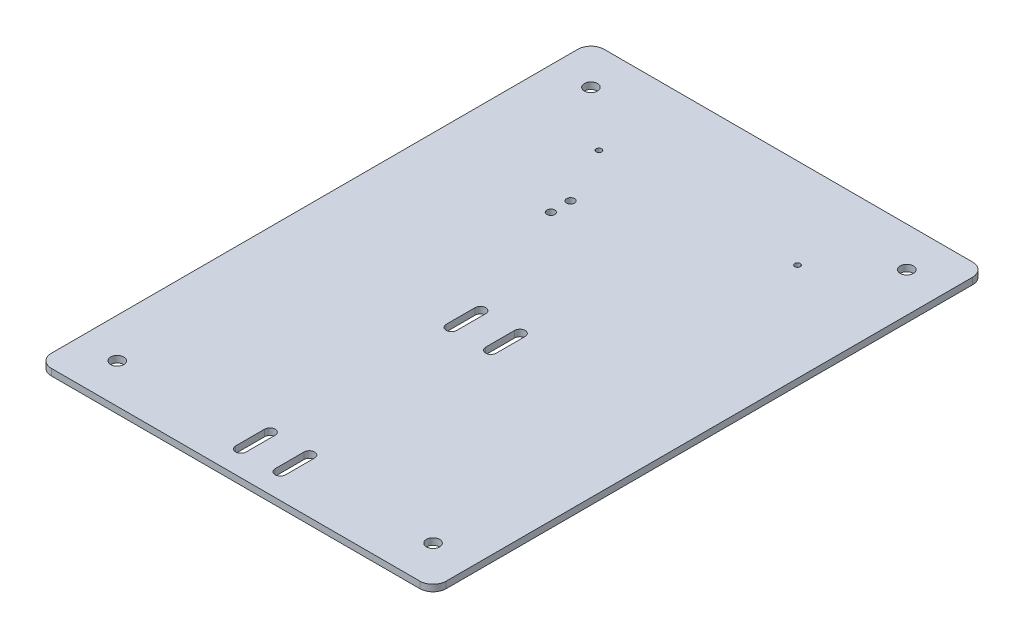
ISO-10303-21;
HEADER;
FILE_DESCRIPTION(('STEP AP214'),'2;1');
FILE_NAME('part.step','',(''),(''),'','','');
FILE_SCHEMA(('AUTOMOTIVE_DESIGN { 1 0 10303 214 1 1 1 1 }'));
ENDSEC;
DATA;
#1=APPLICATION_CONTEXT('core data for automotive mechanical design processes');
#2=APPLICATION_PROTOCOL_DEFINITION('international standard','automotive_design',2000,#1);
#3=PRODUCT_CONTEXT('',#1,'mechanical');
#4=PRODUCT('Part','Part','',(#3));
#5=PRODUCT_RELATED_PRODUCT_CATEGORY('part','',(#4));
#6=PRODUCT_DEFINITION_FORMATION('','',#4);
#7=PRODUCT_DEFINITION_CONTEXT('part definition',#1,'design');
#8=PRODUCT_DEFINITION('design','',#6,#7);
#9=PRODUCT_DEFINITION_SHAPE('','',#8);
#10=(LENGTH_UNIT() NAMED_UNIT(*) SI_UNIT(.MILLI.,.METRE.));
#11=(NAMED_UNIT(*) PLANE_ANGLE_UNIT() SI_UNIT($,.RADIAN.));
#12=(NAMED_UNIT(*) SI_UNIT($,.STERADIAN.) SOLID_ANGLE_UNIT());
#13=UNCERTAINTY_MEASURE_WITH_UNIT(LENGTH_MEASURE(1.E-05),#10,'distance_accuracy_value','');
#14=(GEOMETRIC_REPRESENTATION_CONTEXT(3) GLOBAL_UNCERTAINTY_ASSIGNED_CONTEXT((#13)) GLOBAL_UNIT_ASSIGNED_CONTEXT((#10,
#11,#12)) REPRESENTATION_CONTEXT('',''));
#15=CARTESIAN_POINT('',(0.,0.,0.));
#16=DIRECTION('',(0.,0.,1.));
#17=DIRECTION('',(1.,0.,0.));
#18=AXIS2_PLACEMENT_3D('',#15,#16,#17);
#19=CARTESIAN_POINT('',(-150.,-16.,300.));
#20=DIRECTION('',(1.,0.,0.));
#21=DIRECTION('',(0.,0.,-1.));
#22=AXIS2_PLACEMENT_3D('',#19,#20,#21);
#23=PLANE('',#22);
#24=DIRECTION('',(0.,0.,-1.));
#25=VECTOR('',#24,1.);
#26=CARTESIAN_POINT('',(-150.,-16.,300.));
#27=LINE('',#26,#25);
#28=CARTESIAN_POINT('',(-150.,-16.,290.));
#29=VERTEX_POINT('',#28);
#30=CARTESIAN_POINT('',(-150.,-16.,-110.));
#31=VERTEX_POINT('',#30);
#32=EDGE_CURVE('E382',#29,#31,#27,.T.);
#33=ORIENTED_EDGE('',*,*,#32,.T.);
#34=DIRECTION('',(0.,-1.,0.));
#35=VECTOR('',#34,1.);
#36=CARTESIAN_POINT('',(-150.,-16.,-110.));
#37=LINE('',#36,#35);
#38=CARTESIAN_POINT('',(-150.,-21.,-110.));
#39=VERTEX_POINT('',#38);
#40=EDGE_CURVE('E419',#31,#39,#37,.T.);
#41=ORIENTED_EDGE('',*,*,#40,.T.);
#42=DIRECTION('',(0.,0.,-1.));
#43=VECTOR('',#42,1.);
#44=CARTESIAN_POINT('',(-150.,-21.,300.));
#45=LINE('',#44,#43);
#46=CARTESIAN_POINT('',(-150.,-21.,290.));
#47=VERTEX_POINT('',#46);
#48=EDGE_CURVE('E394',#47,#39,#45,.T.);
#49=ORIENTED_EDGE('',*,*,#48,.F.);
#50=DIRECTION('',(0.,-1.,0.));
#51=VECTOR('',#50,1.);
#52=CARTESIAN_POINT('',(-150.,-16.,290.));
#53=LINE('',#52,#51);
#54=EDGE_CURVE('E398',#47,#29,#53,.F.);
#55=ORIENTED_EDGE('',*,*,#54,.T.);
#56=EDGE_LOOP('',(#33,#41,#49,#55));
#57=FACE_BOUND('',#56,.T.);
#58=ADVANCED_FACE('F45',(#57),#23,.F.);
#59=CARTESIAN_POINT('',(-150.,-21.,300.));
#60=DIRECTION('',(0.,1.,0.));
#61=DIRECTION('',(0.,0.,1.));
#62=AXIS2_PLACEMENT_3D('',#59,#60,#61);
#63=PLANE('',#62);
#64=CARTESIAN_POINT('',(75.5,-21.,-51.5));
#65=DIRECTION('',(0.,1.,0.));
#66=DIRECTION('',(0.,0.,1.));
#67=AXIS2_PLACEMENT_3D('',#64,#65,#66);
#68=CIRCLE('',#67,2.1);
#69=CARTESIAN_POINT('',(75.5,-21.,-49.4));
#70=VERTEX_POINT('',#69);
#71=EDGE_CURVE('E894',#70,#70,#68,.F.);
#72=ORIENTED_EDGE('',*,*,#71,.F.);
#73=EDGE_LOOP('',(#72));
#74=FACE_BOUND('',#73,.T.);
#75=CARTESIAN_POINT('',(-75.5,-21.,-51.5));
#76=DIRECTION('',(0.,1.,0.));
#77=DIRECTION('',(0.,0.,1.));
#78=AXIS2_PLACEMENT_3D('',#75,#76,#77);
#79=CIRCLE('',#78,2.1);
#80=CARTESIAN_POINT('',(-75.5,-21.,-49.4));
#81=VERTEX_POINT('',#80);
#82=EDGE_CURVE('E903',#81,#81,#79,.F.);
#83=ORIENTED_EDGE('',*,*,#82,.F.);
#84=EDGE_LOOP('',(#83));
#85=FACE_BOUND('',#84,.T.);
#86=CARTESIAN_POINT('',(-120.,-21.,270.));
#87=DIRECTION('',(0.,1.,0.));
#88=DIRECTION('',(0.,0.,1.));
#89=AXIS2_PLACEMENT_3D('',#86,#87,#88);
#90=CIRCLE('',#89,5.00000000000003);
#91=CARTESIAN_POINT('',(-120.,-21.,275.));
#92=VERTEX_POINT('',#91);
#93=EDGE_CURVE('E889',#92,#92,#90,.F.);
#94=ORIENTED_EDGE('',*,*,#93,.F.);
#95=EDGE_LOOP('',(#94));
#96=FACE_BOUND('',#95,.T.);
#97=CARTESIAN_POINT('',(120.,-21.,270.));
#98=DIRECTION('',(0.,1.,0.));
#99=DIRECTION('',(0.,0.,1.));
#100=AXIS2_PLACEMENT_3D('',#97,#98,#99);
#101=CIRCLE('',#100,5.00000000000001);
#102=CARTESIAN_POINT('',(120.,-21.,275.));
#103=VERTEX_POINT('',#102);
#104=EDGE_CURVE('E893',#103,#103,#101,.F.);
#105=ORIENTED_EDGE('',*,*,#104,.F.);
#106=EDGE_LOOP('',(#105));
#107=FACE_BOUND('',#106,.T.);
#108=CARTESIAN_POINT('',(120.,-21.,-90.));
#109=DIRECTION('',(0.,1.,0.));
#110=DIRECTION('',(0.,0.,1.));
#111=AXIS2_PLACEMENT_3D('',#108,#109,#110);
#112=CIRCLE('',#111,5.00000000000001);
#113=CARTESIAN_POINT('',(120.,-21.,-85.));
#114=VERTEX_POINT('',#113);
#115=EDGE_CURVE('E888',#114,#114,#112,.F.);
#116=ORIENTED_EDGE('',*,*,#115,.F.);
#117=EDGE_LOOP('',(#116));
#118=FACE_BOUND('',#117,.T.);
#119=CARTESIAN_POINT('',(-120.,-21.,-90.));
#120=DIRECTION('',(0.,1.,0.));
#121=DIRECTION('',(0.,0.,1.));
#122=AXIS2_PLACEMENT_3D('',#119,#120,#121);
#123=CIRCLE('',#122,5.00000000000001);
#124=CARTESIAN_POINT('',(-120.,-21.,-85.));
#125=VERTEX_POINT('',#124);
#126=EDGE_CURVE('E404',#125,#125,#123,.F.);
#127=ORIENTED_EDGE('',*,*,#126,.F.);
#128=EDGE_LOOP('',(#127));
#129=FACE_BOUND('',#128,.T.);
#130=CARTESIAN_POINT('',(-53.,-21.,-7.5));
#131=DIRECTION('',(0.,1.,0.));
#132=DIRECTION('',(0.,0.,1.));
#133=AXIS2_PLACEMENT_3D('',#130,#131,#132);
#134=CIRCLE('',#133,3.);
#135=CARTESIAN_POINT('',(-53.,-21.,-4.5));
#136=VERTEX_POINT('',#135);
#137=EDGE_CURVE('E874',#136,#136,#134,.F.);
#138=ORIENTED_EDGE('',*,*,#137,.F.);
#139=EDGE_LOOP('',(#138));
#140=FACE_BOUND('',#139,.T.);
#141=CARTESIAN_POINT('',(-53.,-21.,7.5));
#142=DIRECTION('',(0.,1.,0.));
#143=DIRECTION('',(0.,0.,1.));
#144=AXIS2_PLACEMENT_3D('',#141,#142,#143);
#145=CIRCLE('',#144,3.);
#146=CARTESIAN_POINT('',(-53.,-21.,10.5));
#147=VERTEX_POINT('',#146);
#148=EDGE_CURVE('E416',#147,#147,#145,.F.);
#149=ORIENTED_EDGE('',*,*,#148,.F.);
#150=EDGE_LOOP('',(#149));
#151=FACE_BOUND('',#150,.T.);
#152=DIRECTION('',(0.,0.,-1.));
#153=VECTOR('',#152,1.);
#154=CARTESIAN_POINT('',(11.0000000000004,-21.,121.));
#155=LINE('',#154,#153);
#156=CARTESIAN_POINT('',(11.0000000000004,-21.,121.));
#157=VERTEX_POINT('',#156);
#158=CARTESIAN_POINT('',(11.0000000000004,-21.,99.0000000000003));
#159=VERTEX_POINT('',#158);
#160=EDGE_CURVE('E280',#157,#159,#155,.T.);
#161=ORIENTED_EDGE('',*,*,#160,.F.);
#162=CARTESIAN_POINT('',(15.0000000000004,-21.,121.));
#163=DIRECTION('',(0.,1.,0.));
#164=DIRECTION('',(0.,0.,1.));
#165=AXIS2_PLACEMENT_3D('',#162,#163,#164);
#166=CIRCLE('',#165,4.00000000000001);
#167=CARTESIAN_POINT('',(19.0000000000004,-21.,121.));
#168=VERTEX_POINT('',#167);
#169=EDGE_CURVE('E246',#168,#157,#166,.F.);
#170=ORIENTED_EDGE('',*,*,#169,.F.);
#171=DIRECTION('',(0.,0.,1.));
#172=VECTOR('',#171,1.);
#173=CARTESIAN_POINT('',(19.0000000000004,-21.,121.));
#174=LINE('',#173,#172);
#175=CARTESIAN_POINT('',(19.0000000000004,-21.,99.0000000000003));
#176=VERTEX_POINT('',#175);
#177=EDGE_CURVE('E243',#176,#168,#174,.T.);
#178=ORIENTED_EDGE('',*,*,#177,.F.);
#179=CARTESIAN_POINT('',(15.0000000000004,-21.,99.0000000000003));
#180=DIRECTION('',(0.,1.,0.));
#181=DIRECTION('',(0.,0.,1.));
#182=AXIS2_PLACEMENT_3D('',#179,#180,#181);
#183=CIRCLE('',#182,4.);
#184=EDGE_CURVE('E262',#159,#176,#183,.F.);
#185=ORIENTED_EDGE('',*,*,#184,.F.);
#186=EDGE_LOOP('',(#161,#170,#178,#185));
#187=FACE_BOUND('',#186,.T.);
#188=DIRECTION('',(0.,0.,1.));
#189=VECTOR('',#188,1.);
#190=CARTESIAN_POINT('',(-11.0000000000004,-21.,259.));
#191=LINE('',#190,#189);
#192=CARTESIAN_POINT('',(-11.0000000000004,-21.,259.));
#193=VERTEX_POINT('',#192);
#194=CARTESIAN_POINT('',(-11.0000000000004,-21.,281.));
#195=VERTEX_POINT('',#194);
#196=EDGE_CURVE('E321',#193,#195,#191,.T.);
#197=ORIENTED_EDGE('',*,*,#196,.F.);
#198=CARTESIAN_POINT('',(-15.0000000000004,-21.,259.));
#199=DIRECTION('',(0.,1.,0.));
#200=DIRECTION('',(0.,0.,1.));
#201=AXIS2_PLACEMENT_3D('',#198,#199,#200);
#202=CIRCLE('',#201,4.);
#203=CARTESIAN_POINT('',(-19.0000000000004,-21.,259.));
#204=VERTEX_POINT('',#203);
#205=EDGE_CURVE('E289',#204,#193,#202,.F.);
#206=ORIENTED_EDGE('',*,*,#205,.F.);
#207=DIRECTION('',(0.,0.,-1.));
#208=VECTOR('',#207,1.);
#209=CARTESIAN_POINT('',(-19.0000000000004,-21.,259.));
#210=LINE('',#209,#208);
#211=CARTESIAN_POINT('',(-19.0000000000004,-21.,281.));
#212=VERTEX_POINT('',#211);
#213=EDGE_CURVE('E286',#212,#204,#210,.T.);
#214=ORIENTED_EDGE('',*,*,#213,.F.);
#215=CARTESIAN_POINT('',(-15.0000000000004,-21.,281.));
#216=DIRECTION('',(0.,1.,0.));
#217=DIRECTION('',(0.,0.,1.));
#218=AXIS2_PLACEMENT_3D('',#215,#216,#217);
#219=CIRCLE('',#218,4.);
#220=EDGE_CURVE('E305',#195,#212,#219,.F.);
#221=ORIENTED_EDGE('',*,*,#220,.F.);
#222=EDGE_LOOP('',(#197,#206,#214,#221));
#223=FACE_BOUND('',#222,.T.);
#224=DIRECTION('',(0.,0.,1.));
#225=VECTOR('',#224,1.);
#226=CARTESIAN_POINT('',(19.0000000000004,-21.,259.));
#227=LINE('',#226,#225);
#228=CARTESIAN_POINT('',(19.0000000000004,-21.,259.));
#229=VERTEX_POINT('',#228);
#230=CARTESIAN_POINT('',(19.0000000000004,-21.,281.));
#231=VERTEX_POINT('',#230);
#232=EDGE_CURVE('E220',#229,#231,#227,.T.);
#233=ORIENTED_EDGE('',*,*,#232,.F.);
#234=CARTESIAN_POINT('',(15.0000000000004,-21.,259.));
#235=DIRECTION('',(0.,1.,0.));
#236=DIRECTION('',(0.,0.,1.));
#237=AXIS2_PLACEMENT_3D('',#234,#235,#236);
#238=CIRCLE('',#237,4.00000000000001);
#239=CARTESIAN_POINT('',(11.0000000000004,-21.,259.));
#240=VERTEX_POINT('',#239);
#241=EDGE_CURVE('E209',#240,#229,#238,.F.);
#242=ORIENTED_EDGE('',*,*,#241,.F.);
#243=DIRECTION('',(0.,0.,-1.));
#244=VECTOR('',#243,1.);
#245=CARTESIAN_POINT('',(11.0000000000004,-21.,259.));
#246=LINE('',#245,#244);
#247=CARTESIAN_POINT('',(11.0000000000004,-21.,281.));
#248=VERTEX_POINT('',#247);
#249=EDGE_CURVE('E221',#248,#240,#246,.T.);
#250=ORIENTED_EDGE('',*,*,#249,.F.);
#251=CARTESIAN_POINT('',(15.0000000000004,-21.,281.));
#252=DIRECTION('',(0.,1.,0.));
#253=DIRECTION('',(0.,0.,1.));
#254=AXIS2_PLACEMENT_3D('',#251,#252,#253);
#255=CIRCLE('',#254,4.);
#256=EDGE_CURVE('E231',#231,#248,#255,.F.);
#257=ORIENTED_EDGE('',*,*,#256,.F.);
#258=EDGE_LOOP('',(#233,#242,#250,#257));
#259=FACE_BOUND('',#258,.T.);
#260=DIRECTION('',(0.,0.,-1.));
#261=VECTOR('',#260,1.);
#262=CARTESIAN_POINT('',(-19.0000000000004,-21.,121.));
#263=LINE('',#262,#261);
#264=CARTESIAN_POINT('',(-19.0000000000004,-21.,121.));
#265=VERTEX_POINT('',#264);
#266=CARTESIAN_POINT('',(-19.0000000000004,-21.,99.0000000000003));
#267=VERTEX_POINT('',#266);
#268=EDGE_CURVE('E331',#265,#267,#263,.T.);
#269=ORIENTED_EDGE('',*,*,#268,.F.);
#270=CARTESIAN_POINT('',(-15.0000000000004,-21.,121.));
#271=DIRECTION('',(0.,1.,0.));
#272=DIRECTION('',(0.,0.,1.));
#273=AXIS2_PLACEMENT_3D('',#270,#271,#272);
#274=CIRCLE('',#273,4.);
#275=CARTESIAN_POINT('',(-11.0000000000004,-21.,121.));
#276=VERTEX_POINT('',#275);
#277=EDGE_CURVE('E335',#276,#265,#274,.F.);
#278=ORIENTED_EDGE('',*,*,#277,.F.);
#279=DIRECTION('',(0.,0.,1.));
#280=VECTOR('',#279,1.);
#281=CARTESIAN_POINT('',(-11.0000000000004,-21.,121.));
#282=LINE('',#281,#280);
#283=CARTESIAN_POINT('',(-11.0000000000004,-21.,99.0000000000003));
#284=VERTEX_POINT('',#283);
#285=EDGE_CURVE('E338',#284,#276,#282,.T.);
#286=ORIENTED_EDGE('',*,*,#285,.F.);
#287=CARTESIAN_POINT('',(-15.0000000000004,-21.,99.0000000000003));
#288=DIRECTION('',(0.,1.,0.));
#289=DIRECTION('',(0.,0.,1.));
#290=AXIS2_PLACEMENT_3D('',#287,#288,#289);
#291=CIRCLE('',#290,4.);
#292=EDGE_CURVE('E327',#267,#284,#291,.F.);
#293=ORIENTED_EDGE('',*,*,#292,.F.);
#294=EDGE_LOOP('',(#269,#278,#286,#293));
#295=FACE_BOUND('',#294,.T.);
#296=ORIENTED_EDGE('',*,*,#48,.T.);
#297=CARTESIAN_POINT('',(-140.,-21.,-110.));
#298=DIRECTION('',(0.,1.,0.));
#299=DIRECTION('',(0.,0.,1.));
#300=AXIS2_PLACEMENT_3D('',#297,#298,#299);
#301=CIRCLE('',#300,10.);
#302=CARTESIAN_POINT('',(-140.,-21.,-120.));
#303=VERTEX_POINT('',#302);
#304=EDGE_CURVE('E432',#39,#303,#301,.F.);
#305=ORIENTED_EDGE('',*,*,#304,.T.);
#306=DIRECTION('',(1.,0.,0.));
#307=VECTOR('',#306,1.);
#308=CARTESIAN_POINT('',(-150.,-21.,-120.));
#309=LINE('',#308,#307);
#310=CARTESIAN_POINT('',(140.,-21.,-120.));
#311=VERTEX_POINT('',#310);
#312=EDGE_CURVE('E367',#303,#311,#309,.T.);
#313=ORIENTED_EDGE('',*,*,#312,.T.);
#314=CARTESIAN_POINT('',(140.,-21.,-110.));
#315=DIRECTION('',(0.,1.,0.));
#316=DIRECTION('',(0.,0.,1.));
#317=AXIS2_PLACEMENT_3D('',#314,#315,#316);
#318=CIRCLE('',#317,10.);
#319=CARTESIAN_POINT('',(150.,-21.,-110.));
#320=VERTEX_POINT('',#319);
#321=EDGE_CURVE('E429',#311,#320,#318,.F.);
#322=ORIENTED_EDGE('',*,*,#321,.T.);
#323=DIRECTION('',(0.,0.,-1.));
#324=VECTOR('',#323,1.);
#325=CARTESIAN_POINT('',(150.,-21.,300.));
#326=LINE('',#325,#324);
#327=CARTESIAN_POINT('',(150.,-21.,290.));
#328=VERTEX_POINT('',#327);
#329=EDGE_CURVE('E390',#328,#320,#326,.T.);
#330=ORIENTED_EDGE('',*,*,#329,.F.);
#331=CARTESIAN_POINT('',(140.,-21.,290.));
#332=DIRECTION('',(0.,1.,0.));
#333=DIRECTION('',(0.,0.,1.));
#334=AXIS2_PLACEMENT_3D('',#331,#332,#333);
#335=CIRCLE('',#334,10.);
#336=CARTESIAN_POINT('',(140.,-21.,300.));
#337=VERTEX_POINT('',#336);
#338=EDGE_CURVE('E426',#328,#337,#335,.F.);
#339=ORIENTED_EDGE('',*,*,#338,.T.);
#340=DIRECTION('',(1.,0.,0.));
#341=VECTOR('',#340,1.);
#342=CARTESIAN_POINT('',(-150.,-21.,300.));
#343=LINE('',#342,#341);
#344=CARTESIAN_POINT('',(-140.,-21.,300.));
#345=VERTEX_POINT('',#344);
#346=EDGE_CURVE('E375',#345,#337,#343,.T.);
#347=ORIENTED_EDGE('',*,*,#346,.F.);
#348=CARTESIAN_POINT('',(-140.,-21.,290.));
#349=DIRECTION('',(0.,1.,0.));
#350=DIRECTION('',(0.,0.,1.));
#351=AXIS2_PLACEMENT_3D('',#348,#349,#350);
#352=CIRCLE('',#351,10.);
#353=EDGE_CURVE('E423',#345,#47,#352,.F.);
#354=ORIENTED_EDGE('',*,*,#353,.T.);
#355=EDGE_LOOP('',(#296,#305,#313,#322,#330,#339,#347,#354));
#356=FACE_BOUND('',#355,.T.);
#357=ADVANCED_FACE('F234',(#74,#85,#96,#107,#118,#129,#140,#151,#187,#223,#259,#295,#356),#63,.F.);
#358=CARTESIAN_POINT('',(150.,-16.,300.));
#359=DIRECTION('',(-1.,0.,0.));
#360=DIRECTION('',(0.,0.,1.));
#361=AXIS2_PLACEMENT_3D('',#358,#359,#360);
#362=PLANE('',#361);
#363=ORIENTED_EDGE('',*,*,#329,.T.);
#364=DIRECTION('',(0.,1.,0.));
#365=VECTOR('',#364,1.);
#366=CARTESIAN_POINT('',(150.,-16.,-110.));
#367=LINE('',#366,#365);
#368=CARTESIAN_POINT('',(150.,-16.,-110.));
#369=VERTEX_POINT('',#368);
#370=EDGE_CURVE('E454',#320,#369,#367,.T.);
#371=ORIENTED_EDGE('',*,*,#370,.T.);
#372=DIRECTION('',(0.,0.,-1.));
#373=VECTOR('',#372,1.);
#374=CARTESIAN_POINT('',(150.,-16.,300.));
#375=LINE('',#374,#373);
#376=CARTESIAN_POINT('',(150.,-16.,290.));
#377=VERTEX_POINT('',#376);
#378=EDGE_CURVE('E386',#377,#369,#375,.T.);
#379=ORIENTED_EDGE('',*,*,#378,.F.);
#380=DIRECTION('',(0.,1.,0.));
#381=VECTOR('',#380,1.);
#382=CARTESIAN_POINT('',(150.,-21.,290.));
#383=LINE('',#382,#381);
#384=EDGE_CURVE('E451',#377,#328,#383,.F.);
#385=ORIENTED_EDGE('',*,*,#384,.T.);
#386=EDGE_LOOP('',(#363,#371,#379,#385));
#387=FACE_BOUND('',#386,.T.);
#388=ADVANCED_FACE('F472',(#387),#362,.F.);
#389=CARTESIAN_POINT('',(-150.,-16.,300.));
#390=DIRECTION('',(0.,-1.,0.));
#391=DIRECTION('',(0.,0.,-1.));
#392=AXIS2_PLACEMENT_3D('',#389,#390,#391);
#393=PLANE('',#392);
#394=CARTESIAN_POINT('',(75.5,-16.,-51.5));
#395=DIRECTION('',(0.,1.,0.));
#396=DIRECTION('',(0.,0.,1.));
#397=AXIS2_PLACEMENT_3D('',#394,#395,#396);
#398=CIRCLE('',#397,2.1);
#399=CARTESIAN_POINT('',(75.5,-16.,-49.4));
#400=VERTEX_POINT('',#399);
#401=EDGE_CURVE('E810',#400,#400,#398,.T.);
#402=ORIENTED_EDGE('',*,*,#401,.F.);
#403=EDGE_LOOP('',(#402));
#404=FACE_BOUND('',#403,.T.);
#405=CARTESIAN_POINT('',(-75.5,-16.,-51.5));
#406=DIRECTION('',(0.,1.,0.));
#407=DIRECTION('',(0.,0.,1.));
#408=AXIS2_PLACEMENT_3D('',#405,#406,#407);
#409=CIRCLE('',#408,2.1);
#410=CARTESIAN_POINT('',(-75.5,-16.,-49.4));
#411=VERTEX_POINT('',#410);
#412=EDGE_CURVE('E814',#411,#411,#409,.T.);
#413=ORIENTED_EDGE('',*,*,#412,.F.);
#414=EDGE_LOOP('',(#413));
#415=FACE_BOUND('',#414,.T.);
#416=CARTESIAN_POINT('',(-120.,-16.,270.));
#417=DIRECTION('',(0.,-1.,0.));
#418=DIRECTION('',(0.,0.,-1.));
#419=AXIS2_PLACEMENT_3D('',#416,#417,#418);
#420=CIRCLE('',#419,5.00000000000003);
#421=CARTESIAN_POINT('',(-120.,-16.,265.));
#422=VERTEX_POINT('',#421);
#423=EDGE_CURVE('E412',#422,#422,#420,.T.);
#424=ORIENTED_EDGE('',*,*,#423,.T.);
#425=EDGE_LOOP('',(#424));
#426=FACE_BOUND('',#425,.T.);
#427=CARTESIAN_POINT('',(120.,-16.,270.));
#428=DIRECTION('',(0.,-1.,0.));
#429=DIRECTION('',(0.,0.,-1.));
#430=AXIS2_PLACEMENT_3D('',#427,#428,#429);
#431=CIRCLE('',#430,5.00000000000001);
#432=CARTESIAN_POINT('',(120.,-16.,265.));
#433=VERTEX_POINT('',#432);
#434=EDGE_CURVE('E408',#433,#433,#431,.T.);
#435=ORIENTED_EDGE('',*,*,#434,.T.);
#436=EDGE_LOOP('',(#435));
#437=FACE_BOUND('',#436,.T.);
#438=CARTESIAN_POINT('',(120.,-16.,-90.));
#439=DIRECTION('',(0.,-1.,0.));
#440=DIRECTION('',(0.,0.,-1.));
#441=AXIS2_PLACEMENT_3D('',#438,#439,#440);
#442=CIRCLE('',#441,5.00000000000001);
#443=CARTESIAN_POINT('',(120.,-16.,-95.));
#444=VERTEX_POINT('',#443);
#445=EDGE_CURVE('E403',#444,#444,#442,.T.);
#446=ORIENTED_EDGE('',*,*,#445,.T.);
#447=EDGE_LOOP('',(#446));
#448=FACE_BOUND('',#447,.T.);
#449=CARTESIAN_POINT('',(-120.,-16.,-90.));
#450=DIRECTION('',(0.,-1.,0.));
#451=DIRECTION('',(0.,0.,-1.));
#452=AXIS2_PLACEMENT_3D('',#449,#450,#451);
#453=CIRCLE('',#452,5.00000000000001);
#454=CARTESIAN_POINT('',(-120.,-16.,-95.));
#455=VERTEX_POINT('',#454);
#456=EDGE_CURVE('E399',#455,#455,#453,.T.);
#457=ORIENTED_EDGE('',*,*,#456,.T.);
#458=EDGE_LOOP('',(#457));
#459=FACE_BOUND('',#458,.T.);
#460=CARTESIAN_POINT('',(-53.,-16.,-7.5));
#461=DIRECTION('',(0.,1.,0.));
#462=DIRECTION('',(0.,0.,1.));
#463=AXIS2_PLACEMENT_3D('',#460,#461,#462);
#464=CIRCLE('',#463,3.);
#465=CARTESIAN_POINT('',(-53.,-16.,-4.5));
#466=VERTEX_POINT('',#465);
#467=EDGE_CURVE('E826',#466,#466,#464,.T.);
#468=ORIENTED_EDGE('',*,*,#467,.F.);
#469=EDGE_LOOP('',(#468));
#470=FACE_BOUND('',#469,.T.);
#471=CARTESIAN_POINT('',(-53.,-16.,7.5));
#472=DIRECTION('',(0.,1.,0.));
#473=DIRECTION('',(0.,0.,1.));
#474=AXIS2_PLACEMENT_3D('',#471,#472,#473);
#475=CIRCLE('',#474,3.);
#476=CARTESIAN_POINT('',(-53.,-16.,10.5));
#477=VERTEX_POINT('',#476);
#478=EDGE_CURVE('E830',#477,#477,#475,.T.);
#479=ORIENTED_EDGE('',*,*,#478,.F.);
#480=EDGE_LOOP('',(#479));
#481=FACE_BOUND('',#480,.T.);
#482=DIRECTION('',(0.,0.,-1.));
#483=VECTOR('',#482,1.);
#484=CARTESIAN_POINT('',(19.0000000000004,-16.,121.));
#485=LINE('',#484,#483);
#486=CARTESIAN_POINT('',(19.0000000000004,-16.,121.));
#487=VERTEX_POINT('',#486);
#488=CARTESIAN_POINT('',(19.0000000000004,-16.,99.0000000000003));
#489=VERTEX_POINT('',#488);
#490=EDGE_CURVE('E270',#487,#489,#485,.T.);
#491=ORIENTED_EDGE('',*,*,#490,.F.);
#492=CARTESIAN_POINT('',(15.0000000000004,-16.,121.));
#493=DIRECTION('',(0.,1.,0.));
#494=DIRECTION('',(0.,0.,-1.));
#495=AXIS2_PLACEMENT_3D('',#492,#493,#494);
#496=CIRCLE('',#495,4.00000000000001);
#497=CARTESIAN_POINT('',(11.0000000000004,-16.,121.));
#498=VERTEX_POINT('',#497);
#499=EDGE_CURVE('E274',#498,#487,#496,.T.);
#500=ORIENTED_EDGE('',*,*,#499,.F.);
#501=DIRECTION('',(0.,0.,1.));
#502=VECTOR('',#501,1.);
#503=CARTESIAN_POINT('',(11.0000000000004,-16.,121.));
#504=LINE('',#503,#502);
#505=CARTESIAN_POINT('',(11.0000000000004,-16.,99.0000000000003));
#506=VERTEX_POINT('',#505);
#507=EDGE_CURVE('E252',#506,#498,#504,.T.);
#508=ORIENTED_EDGE('',*,*,#507,.F.);
#509=CARTESIAN_POINT('',(15.0000000000004,-16.,99.0000000000003));
#510=DIRECTION('',(0.,1.,0.));
#511=DIRECTION('',(0.,0.,-1.));
#512=AXIS2_PLACEMENT_3D('',#509,#510,#511);
#513=CIRCLE('',#512,4.);
#514=EDGE_CURVE('E266',#489,#506,#513,.T.);
#515=ORIENTED_EDGE('',*,*,#514,.F.);
#516=EDGE_LOOP('',(#491,#500,#508,#515));
#517=FACE_BOUND('',#516,.T.);
#518=DIRECTION('',(0.,0.,1.));
#519=VECTOR('',#518,1.);
#520=CARTESIAN_POINT('',(-19.0000000000004,-16.,259.));
#521=LINE('',#520,#519);
#522=CARTESIAN_POINT('',(-19.0000000000004,-16.,259.));
#523=VERTEX_POINT('',#522);
#524=CARTESIAN_POINT('',(-19.0000000000004,-16.,281.));
#525=VERTEX_POINT('',#524);
#526=EDGE_CURVE('E313',#523,#525,#521,.T.);
#527=ORIENTED_EDGE('',*,*,#526,.F.);
#528=CARTESIAN_POINT('',(-15.0000000000004,-16.,259.));
#529=DIRECTION('',(0.,1.,0.));
#530=DIRECTION('',(0.,0.,-1.));
#531=AXIS2_PLACEMENT_3D('',#528,#529,#530);
#532=CIRCLE('',#531,4.);
#533=CARTESIAN_POINT('',(-11.0000000000004,-16.,259.));
#534=VERTEX_POINT('',#533);
#535=EDGE_CURVE('E247',#534,#523,#532,.T.);
#536=ORIENTED_EDGE('',*,*,#535,.F.);
#537=DIRECTION('',(0.,0.,-1.));
#538=VECTOR('',#537,1.);
#539=CARTESIAN_POINT('',(-11.0000000000004,-16.,259.));
#540=LINE('',#539,#538);
#541=CARTESIAN_POINT('',(-11.0000000000004,-16.,281.));
#542=VERTEX_POINT('',#541);
#543=EDGE_CURVE('E295',#542,#534,#540,.T.);
#544=ORIENTED_EDGE('',*,*,#543,.F.);
#545=CARTESIAN_POINT('',(-15.0000000000004,-16.,281.));
#546=DIRECTION('',(0.,1.,0.));
#547=DIRECTION('',(0.,0.,-1.));
#548=AXIS2_PLACEMENT_3D('',#545,#546,#547);
#549=CIRCLE('',#548,4.);
#550=EDGE_CURVE('E309',#525,#542,#549,.T.);
#551=ORIENTED_EDGE('',*,*,#550,.F.);
#552=EDGE_LOOP('',(#527,#536,#544,#551));
#553=FACE_BOUND('',#552,.T.);
#554=DIRECTION('',(0.,0.,1.));
#555=VECTOR('',#554,1.);
#556=CARTESIAN_POINT('',(11.0000000000004,-16.,259.));
#557=LINE('',#556,#555);
#558=CARTESIAN_POINT('',(11.0000000000004,-16.,259.));
#559=VERTEX_POINT('',#558);
#560=CARTESIAN_POINT('',(11.0000000000004,-16.,281.));
#561=VERTEX_POINT('',#560);
#562=EDGE_CURVE('E843',#559,#561,#557,.T.);
#563=ORIENTED_EDGE('',*,*,#562,.F.);
#564=CARTESIAN_POINT('',(15.0000000000004,-16.,259.));
#565=DIRECTION('',(0.,1.,0.));
#566=DIRECTION('',(0.,0.,1.));
#567=AXIS2_PLACEMENT_3D('',#564,#565,#566);
#568=CIRCLE('',#567,4.00000000000001);
#569=CARTESIAN_POINT('',(19.0000000000004,-16.,259.));
#570=VERTEX_POINT('',#569);
#571=EDGE_CURVE('E290',#570,#559,#568,.T.);
#572=ORIENTED_EDGE('',*,*,#571,.F.);
#573=DIRECTION('',(0.,0.,-1.));
#574=VECTOR('',#573,1.);
#575=CARTESIAN_POINT('',(19.0000000000004,-16.,259.));
#576=LINE('',#575,#574);
#577=CARTESIAN_POINT('',(19.0000000000004,-16.,281.));
#578=VERTEX_POINT('',#577);
#579=EDGE_CURVE('E227',#578,#570,#576,.T.);
#580=ORIENTED_EDGE('',*,*,#579,.F.);
#581=CARTESIAN_POINT('',(15.0000000000004,-16.,281.));
#582=DIRECTION('',(0.,1.,0.));
#583=DIRECTION('',(0.,0.,1.));
#584=AXIS2_PLACEMENT_3D('',#581,#582,#583);
#585=CIRCLE('',#584,4.);
#586=EDGE_CURVE('E856',#561,#578,#585,.T.);
#587=ORIENTED_EDGE('',*,*,#586,.F.);
#588=EDGE_LOOP('',(#563,#572,#580,#587));
#589=FACE_BOUND('',#588,.T.);
#590=DIRECTION('',(0.,0.,-1.));
#591=VECTOR('',#590,1.);
#592=CARTESIAN_POINT('',(-11.0000000000004,-16.,121.));
#593=LINE('',#592,#591);
#594=CARTESIAN_POINT('',(-11.0000000000004,-16.,121.));
#595=VERTEX_POINT('',#594);
#596=CARTESIAN_POINT('',(-11.0000000000004,-16.,99.0000000000003));
#597=VERTEX_POINT('',#596);
#598=EDGE_CURVE('E341',#595,#597,#593,.T.);
#599=ORIENTED_EDGE('',*,*,#598,.F.);
#600=CARTESIAN_POINT('',(-15.0000000000004,-16.,121.));
#601=DIRECTION('',(0.,1.,0.));
#602=DIRECTION('',(0.,0.,1.));
#603=AXIS2_PLACEMENT_3D('',#600,#601,#602);
#604=CIRCLE('',#603,4.);
#605=CARTESIAN_POINT('',(-19.0000000000004,-16.,121.));
#606=VERTEX_POINT('',#605);
#607=EDGE_CURVE('E277',#606,#595,#604,.T.);
#608=ORIENTED_EDGE('',*,*,#607,.F.);
#609=DIRECTION('',(0.,0.,1.));
#610=VECTOR('',#609,1.);
#611=CARTESIAN_POINT('',(-19.0000000000004,-16.,121.));
#612=LINE('',#611,#610);
#613=CARTESIAN_POINT('',(-19.0000000000004,-16.,99.0000000000003));
#614=VERTEX_POINT('',#613);
#615=EDGE_CURVE('E349',#614,#606,#612,.T.);
#616=ORIENTED_EDGE('',*,*,#615,.F.);
#617=CARTESIAN_POINT('',(-15.0000000000004,-16.,99.0000000000003));
#618=DIRECTION('',(0.,1.,0.));
#619=DIRECTION('',(0.,0.,1.));
#620=AXIS2_PLACEMENT_3D('',#617,#618,#619);
#621=CIRCLE('',#620,4.);
#622=EDGE_CURVE('E345',#597,#614,#621,.T.);
#623=ORIENTED_EDGE('',*,*,#622,.F.);
#624=EDGE_LOOP('',(#599,#608,#616,#623));
#625=FACE_BOUND('',#624,.T.);
#626=DIRECTION('',(-1.,0.,0.));
#627=VECTOR('',#626,1.);
#628=CARTESIAN_POINT('',(-150.,-16.,-120.));
#629=LINE('',#628,#627);
#630=CARTESIAN_POINT('',(140.,-16.,-120.));
#631=VERTEX_POINT('',#630);
#632=CARTESIAN_POINT('',(-140.,-16.,-120.));
#633=VERTEX_POINT('',#632);
#634=EDGE_CURVE('E371',#631,#633,#629,.T.);
#635=ORIENTED_EDGE('',*,*,#634,.T.);
#636=CARTESIAN_POINT('',(-140.,-16.,-110.));
#637=DIRECTION('',(0.,-1.,0.));
#638=DIRECTION('',(0.,0.,-1.));
#639=AXIS2_PLACEMENT_3D('',#636,#637,#638);
#640=CIRCLE('',#639,10.);
#641=EDGE_CURVE('E448',#633,#31,#640,.F.);
#642=ORIENTED_EDGE('',*,*,#641,.T.);
#643=ORIENTED_EDGE('',*,*,#32,.F.);
#644=CARTESIAN_POINT('',(-140.,-16.,290.));
#645=DIRECTION('',(0.,-1.,0.));
#646=DIRECTION('',(0.,0.,-1.));
#647=AXIS2_PLACEMENT_3D('',#644,#645,#646);
#648=CIRCLE('',#647,10.);
#649=CARTESIAN_POINT('',(-140.,-16.,300.));
#650=VERTEX_POINT('',#649);
#651=EDGE_CURVE('E61',#29,#650,#648,.F.);
#652=ORIENTED_EDGE('',*,*,#651,.T.);
#653=DIRECTION('',(-1.,0.,0.));
#654=VECTOR('',#653,1.);
#655=CARTESIAN_POINT('',(-150.,-16.,300.));
#656=LINE('',#655,#654);
#657=CARTESIAN_POINT('',(140.,-16.,300.));
#658=VERTEX_POINT('',#657);
#659=EDGE_CURVE('E379',#658,#650,#656,.T.);
#660=ORIENTED_EDGE('',*,*,#659,.F.);
#661=CARTESIAN_POINT('',(140.,-16.,290.));
#662=DIRECTION('',(0.,-1.,0.));
#663=DIRECTION('',(0.,0.,-1.));
#664=AXIS2_PLACEMENT_3D('',#661,#662,#663);
#665=CIRCLE('',#664,10.);
#666=EDGE_CURVE('E69',#658,#377,#665,.F.);
#667=ORIENTED_EDGE('',*,*,#666,.T.);
#668=ORIENTED_EDGE('',*,*,#378,.T.);
#669=CARTESIAN_POINT('',(140.,-16.,-110.));
#670=DIRECTION('',(0.,-1.,0.));
#671=DIRECTION('',(0.,0.,-1.));
#672=AXIS2_PLACEMENT_3D('',#669,#670,#671);
#673=CIRCLE('',#672,10.);
#674=EDGE_CURVE('E445',#369,#631,#673,.F.);
#675=ORIENTED_EDGE('',*,*,#674,.T.);
#676=EDGE_LOOP('',(#635,#642,#643,#652,#660,#667,#668,#675));
#677=FACE_BOUND('',#676,.T.);
#678=ADVANCED_FACE('F469',(#404,#415,#426,#437,#448,#459,#470,#481,#517,#553,#589,#625,#677),
#393,.F.);
#679=CARTESIAN_POINT('',(0.,0.,300.));
#680=DIRECTION('',(0.,0.,1.));
#681=DIRECTION('',(1.,0.,0.));
#682=AXIS2_PLACEMENT_3D('',#679,#680,#681);
#683=PLANE('',#682);
#684=ORIENTED_EDGE('',*,*,#346,.T.);
#685=DIRECTION('',(0.,1.,0.));
#686=VECTOR('',#685,1.);
#687=CARTESIAN_POINT('',(140.,-16.,300.));
#688=LINE('',#687,#686);
#689=EDGE_CURVE('E11',#337,#658,#688,.T.);
#690=ORIENTED_EDGE('',*,*,#689,.T.);
#691=ORIENTED_EDGE('',*,*,#659,.T.);
#692=DIRECTION('',(0.,-1.,0.));
#693=VECTOR('',#692,1.);
#694=CARTESIAN_POINT('',(-140.,-21.,300.));
#695=LINE('',#694,#693);
#696=EDGE_CURVE('E54',#650,#345,#695,.T.);
#697=ORIENTED_EDGE('',*,*,#696,.T.);
#698=EDGE_LOOP('',(#684,#690,#691,#697));
#699=FACE_BOUND('',#698,.T.);
#700=ADVANCED_FACE('F462',(#699),#683,.T.);
#701=CARTESIAN_POINT('',(0.,0.,-120.));
#702=DIRECTION('',(0.,0.,1.));
#703=DIRECTION('',(1.,0.,0.));
#704=AXIS2_PLACEMENT_3D('',#701,#702,#703);
#705=PLANE('',#704);
#706=ORIENTED_EDGE('',*,*,#312,.F.);
#707=DIRECTION('',(0.,-1.,0.));
#708=VECTOR('',#707,1.);
#709=CARTESIAN_POINT('',(-140.,0.,-120.));
#710=LINE('',#709,#708);
#711=EDGE_CURVE('E438',#303,#633,#710,.F.);
#712=ORIENTED_EDGE('',*,*,#711,.T.);
#713=ORIENTED_EDGE('',*,*,#634,.F.);
#714=DIRECTION('',(0.,1.,0.));
#715=VECTOR('',#714,1.);
#716=CARTESIAN_POINT('',(140.,0.,-120.));
#717=LINE('',#716,#715);
#718=EDGE_CURVE('E435',#631,#311,#717,.F.);
#719=ORIENTED_EDGE('',*,*,#718,.T.);
#720=EDGE_LOOP('',(#706,#712,#713,#719));
#721=FACE_BOUND('',#720,.T.);
#722=ADVANCED_FACE('F482',(#721),#705,.F.);
#723=CARTESIAN_POINT('',(-15.0000000000004,-52.0483493925201,121.));
#724=DIRECTION('',(0.,1.,0.));
#725=DIRECTION('',(0.,0.,1.));
#726=AXIS2_PLACEMENT_3D('',#723,#724,#725);
#727=CYLINDRICAL_SURFACE('',#726,4.);
#728=ORIENTED_EDGE('',*,*,#277,.T.);
#729=DIRECTION('',(0.,1.,0.));
#730=VECTOR('',#729,1.);
#731=CARTESIAN_POINT('',(-19.0000000000004,-52.0483493925201,121.));
#732=LINE('',#731,#730);
#733=EDGE_CURVE('E332',#265,#606,#732,.T.);
#734=ORIENTED_EDGE('',*,*,#733,.T.);
#735=ORIENTED_EDGE('',*,*,#607,.T.);
#736=DIRECTION('',(0.,1.,0.));
#737=VECTOR('',#736,1.);
#738=CARTESIAN_POINT('',(-11.0000000000004,-52.0483493925201,121.));
#739=LINE('',#738,#737);
#740=EDGE_CURVE('E353',#276,#595,#739,.T.);
#741=ORIENTED_EDGE('',*,*,#740,.F.);
#742=EDGE_LOOP('',(#728,#734,#735,#741));
#743=FACE_BOUND('',#742,.T.);
#744=ADVANCED_FACE('F621',(#743),#727,.F.);
#745=CARTESIAN_POINT('',(-19.0000000000004,-52.0483493925201,121.));
#746=DIRECTION('',(-1.,0.,0.));
#747=DIRECTION('',(0.,0.,1.));
#748=AXIS2_PLACEMENT_3D('',#745,#746,#747);
#749=PLANE('',#748);
#750=ORIENTED_EDGE('',*,*,#268,.T.);
#751=DIRECTION('',(0.,1.,0.));
#752=VECTOR('',#751,1.);
#753=CARTESIAN_POINT('',(-19.0000000000004,-52.0483493925201,99.0000000000003));
#754=LINE('',#753,#752);
#755=EDGE_CURVE('E356',#267,#614,#754,.T.);
#756=ORIENTED_EDGE('',*,*,#755,.T.);
#757=ORIENTED_EDGE('',*,*,#615,.T.);
#758=ORIENTED_EDGE('',*,*,#733,.F.);
#759=EDGE_LOOP('',(#750,#756,#757,#758));
#760=FACE_BOUND('',#759,.T.);
#761=ADVANCED_FACE('F617',(#760),#749,.F.);
#762=CARTESIAN_POINT('',(-15.0000000000004,-52.0483493925201,99.0000000000003));
#763=DIRECTION('',(0.,1.,0.));
#764=DIRECTION('',(0.,0.,1.));
#765=AXIS2_PLACEMENT_3D('',#762,#763,#764);
#766=CYLINDRICAL_SURFACE('',#765,4.);
#767=ORIENTED_EDGE('',*,*,#292,.T.);
#768=DIRECTION('',(0.,1.,0.));
#769=VECTOR('',#768,1.);
#770=CARTESIAN_POINT('',(-11.0000000000004,-52.0483493925201,99.0000000000003));
#771=LINE('',#770,#769);
#772=EDGE_CURVE('E359',#284,#597,#771,.T.);
#773=ORIENTED_EDGE('',*,*,#772,.T.);
#774=ORIENTED_EDGE('',*,*,#622,.T.);
#775=ORIENTED_EDGE('',*,*,#755,.F.);
#776=EDGE_LOOP('',(#767,#773,#774,#775));
#777=FACE_BOUND('',#776,.T.);
#778=ADVANCED_FACE('F620',(#777),#766,.F.);
#779=CARTESIAN_POINT('',(-11.0000000000004,-52.0483493925201,121.));
#780=DIRECTION('',(1.,0.,0.));
#781=DIRECTION('',(0.,0.,-1.));
#782=AXIS2_PLACEMENT_3D('',#779,#780,#781);
#783=PLANE('',#782);
#784=ORIENTED_EDGE('',*,*,#285,.T.);
#785=ORIENTED_EDGE('',*,*,#740,.T.);
#786=ORIENTED_EDGE('',*,*,#598,.T.);
#787=ORIENTED_EDGE('',*,*,#772,.F.);
#788=EDGE_LOOP('',(#784,#785,#786,#787));
#789=FACE_BOUND('',#788,.T.);
#790=ADVANCED_FACE('F575',(#789),#783,.F.);
#791=CARTESIAN_POINT('',(15.0000000000004,-52.0483493925201,259.));
#792=DIRECTION('',(0.,1.,0.));
#793=DIRECTION('',(0.,0.,1.));
#794=AXIS2_PLACEMENT_3D('',#791,#792,#793);
#795=CYLINDRICAL_SURFACE('',#794,4.00000000000001);
#796=ORIENTED_EDGE('',*,*,#241,.T.);
#797=DIRECTION('',(0.,1.,0.));
#798=VECTOR('',#797,1.);
#799=CARTESIAN_POINT('',(19.0000000000004,-52.0483493925201,259.));
#800=LINE('',#799,#798);
#801=EDGE_CURVE('E212',#229,#570,#800,.T.);
#802=ORIENTED_EDGE('',*,*,#801,.T.);
#803=ORIENTED_EDGE('',*,*,#571,.T.);
#804=DIRECTION('',(0.,1.,0.));
#805=VECTOR('',#804,1.);
#806=CARTESIAN_POINT('',(11.0000000000004,-52.0483493925201,259.));
#807=LINE('',#806,#805);
#808=EDGE_CURVE('E215',#240,#559,#807,.T.);
#809=ORIENTED_EDGE('',*,*,#808,.F.);
#810=EDGE_LOOP('',(#796,#802,#803,#809));
#811=FACE_BOUND('',#810,.T.);
#812=ADVANCED_FACE('F211',(#811),#795,.F.);
#813=CARTESIAN_POINT('',(19.0000000000004,-52.0483493925201,259.));
#814=DIRECTION('',(1.,0.,0.));
#815=DIRECTION('',(0.,0.,-1.));
#816=AXIS2_PLACEMENT_3D('',#813,#814,#815);
#817=PLANE('',#816);
#818=ORIENTED_EDGE('',*,*,#232,.T.);
#819=DIRECTION('',(0.,1.,0.));
#820=VECTOR('',#819,1.);
#821=CARTESIAN_POINT('',(19.0000000000004,-52.0483493925201,281.));
#822=LINE('',#821,#820);
#823=EDGE_CURVE('E230',#231,#578,#822,.T.);
#824=ORIENTED_EDGE('',*,*,#823,.T.);
#825=ORIENTED_EDGE('',*,*,#579,.T.);
#826=ORIENTED_EDGE('',*,*,#801,.F.);
#827=EDGE_LOOP('',(#818,#824,#825,#826));
#828=FACE_BOUND('',#827,.T.);
#829=ADVANCED_FACE('F224',(#828),#817,.F.);
#830=CARTESIAN_POINT('',(15.0000000000004,-52.0483493925201,281.));
#831=DIRECTION('',(0.,1.,0.));
#832=DIRECTION('',(0.,0.,1.));
#833=AXIS2_PLACEMENT_3D('',#830,#831,#832);
#834=CYLINDRICAL_SURFACE('',#833,4.);
#835=ORIENTED_EDGE('',*,*,#256,.T.);
#836=DIRECTION('',(0.,1.,0.));
#837=VECTOR('',#836,1.);
#838=CARTESIAN_POINT('',(11.0000000000004,-52.0483493925201,281.));
#839=LINE('',#838,#837);
#840=EDGE_CURVE('E867',#248,#561,#839,.T.);
#841=ORIENTED_EDGE('',*,*,#840,.T.);
#842=ORIENTED_EDGE('',*,*,#586,.T.);
#843=ORIENTED_EDGE('',*,*,#823,.F.);
#844=EDGE_LOOP('',(#835,#841,#842,#843));
#845=FACE_BOUND('',#844,.T.);
#846=ADVANCED_FACE('F580',(#845),#834,.F.);
#847=CARTESIAN_POINT('',(11.0000000000004,-52.0483493925201,259.));
#848=DIRECTION('',(-1.,0.,0.));
#849=DIRECTION('',(0.,0.,1.));
#850=AXIS2_PLACEMENT_3D('',#847,#848,#849);
#851=PLANE('',#850);
#852=ORIENTED_EDGE('',*,*,#249,.T.);
#853=ORIENTED_EDGE('',*,*,#808,.T.);
#854=ORIENTED_EDGE('',*,*,#562,.T.);
#855=ORIENTED_EDGE('',*,*,#840,.F.);
#856=EDGE_LOOP('',(#852,#853,#854,#855));
#857=FACE_BOUND('',#856,.T.);
#858=ADVANCED_FACE('F576',(#857),#851,.F.);
#859=CARTESIAN_POINT('',(-15.0000000000004,-52.0483493925201,259.));
#860=DIRECTION('',(0.,1.,0.));
#861=DIRECTION('',(0.,0.,1.));
#862=AXIS2_PLACEMENT_3D('',#859,#860,#861);
#863=CYLINDRICAL_SURFACE('',#862,4.);
#864=ORIENTED_EDGE('',*,*,#205,.T.);
#865=DIRECTION('',(0.,1.,0.));
#866=VECTOR('',#865,1.);
#867=CARTESIAN_POINT('',(-11.0000000000004,-52.0483493925201,259.));
#868=LINE('',#867,#866);
#869=EDGE_CURVE('E302',#193,#534,#868,.T.);
#870=ORIENTED_EDGE('',*,*,#869,.T.);
#871=ORIENTED_EDGE('',*,*,#535,.T.);
#872=DIRECTION('',(0.,1.,0.));
#873=VECTOR('',#872,1.);
#874=CARTESIAN_POINT('',(-19.0000000000004,-52.0483493925201,259.));
#875=LINE('',#874,#873);
#876=EDGE_CURVE('E291',#204,#523,#875,.T.);
#877=ORIENTED_EDGE('',*,*,#876,.F.);
#878=EDGE_LOOP('',(#864,#870,#871,#877));
#879=FACE_BOUND('',#878,.T.);
#880=ADVANCED_FACE('F579',(#879),#863,.F.);
#881=CARTESIAN_POINT('',(-11.0000000000004,-52.0483493925201,259.));
#882=DIRECTION('',(1.,0.,0.));
#883=DIRECTION('',(0.,0.,-1.));
#884=AXIS2_PLACEMENT_3D('',#881,#882,#883);
#885=PLANE('',#884);
#886=ORIENTED_EDGE('',*,*,#196,.T.);
#887=DIRECTION('',(0.,1.,0.));
#888=VECTOR('',#887,1.);
#889=CARTESIAN_POINT('',(-11.0000000000004,-52.0483493925201,281.));
#890=LINE('',#889,#888);
#891=EDGE_CURVE('E299',#195,#542,#890,.T.);
#892=ORIENTED_EDGE('',*,*,#891,.T.);
#893=ORIENTED_EDGE('',*,*,#543,.T.);
#894=ORIENTED_EDGE('',*,*,#869,.F.);
#895=EDGE_LOOP('',(#886,#892,#893,#894));
#896=FACE_BOUND('',#895,.T.);
#897=ADVANCED_FACE('F605',(#896),#885,.F.);
#898=CARTESIAN_POINT('',(-15.0000000000004,-52.0483493925201,281.));
#899=DIRECTION('',(0.,1.,0.));
#900=DIRECTION('',(0.,0.,1.));
#901=AXIS2_PLACEMENT_3D('',#898,#899,#900);
#902=CYLINDRICAL_SURFACE('',#901,4.);
#903=ORIENTED_EDGE('',*,*,#220,.T.);
#904=DIRECTION('',(0.,1.,0.));
#905=VECTOR('',#904,1.);
#906=CARTESIAN_POINT('',(-19.0000000000004,-52.0483493925201,281.));
#907=LINE('',#906,#905);
#908=EDGE_CURVE('E296',#212,#525,#907,.T.);
#909=ORIENTED_EDGE('',*,*,#908,.T.);
#910=ORIENTED_EDGE('',*,*,#550,.T.);
#911=ORIENTED_EDGE('',*,*,#891,.F.);
#912=EDGE_LOOP('',(#903,#909,#910,#911));
#913=FACE_BOUND('',#912,.T.);
#914=ADVANCED_FACE('F609',(#913),#902,.F.);
#915=CARTESIAN_POINT('',(-19.0000000000004,-52.0483493925201,259.));
#916=DIRECTION('',(-1.,0.,0.));
#917=DIRECTION('',(0.,0.,1.));
#918=AXIS2_PLACEMENT_3D('',#915,#916,#917);
#919=PLANE('',#918);
#920=ORIENTED_EDGE('',*,*,#213,.T.);
#921=ORIENTED_EDGE('',*,*,#876,.T.);
#922=ORIENTED_EDGE('',*,*,#526,.T.);
#923=ORIENTED_EDGE('',*,*,#908,.F.);
#924=EDGE_LOOP('',(#920,#921,#922,#923));
#925=FACE_BOUND('',#924,.T.);
#926=ADVANCED_FACE('F591',(#925),#919,.F.);
#927=CARTESIAN_POINT('',(15.0000000000004,-52.0483493925201,121.));
#928=DIRECTION('',(0.,1.,0.));
#929=DIRECTION('',(0.,0.,1.));
#930=AXIS2_PLACEMENT_3D('',#927,#928,#929);
#931=CYLINDRICAL_SURFACE('',#930,4.00000000000001);
#932=ORIENTED_EDGE('',*,*,#169,.T.);
#933=DIRECTION('',(0.,1.,0.));
#934=VECTOR('',#933,1.);
#935=CARTESIAN_POINT('',(11.0000000000004,-52.0483493925201,121.));
#936=LINE('',#935,#934);
#937=EDGE_CURVE('E259',#157,#498,#936,.T.);
#938=ORIENTED_EDGE('',*,*,#937,.T.);
#939=ORIENTED_EDGE('',*,*,#499,.T.);
#940=DIRECTION('',(0.,1.,0.));
#941=VECTOR('',#940,1.);
#942=CARTESIAN_POINT('',(19.0000000000004,-52.0483493925201,121.));
#943=LINE('',#942,#941);
#944=EDGE_CURVE('E248',#168,#487,#943,.T.);
#945=ORIENTED_EDGE('',*,*,#944,.F.);
#946=EDGE_LOOP('',(#932,#938,#939,#945));
#947=FACE_BOUND('',#946,.T.);
#948=ADVANCED_FACE('F587',(#947),#931,.F.);
#949=CARTESIAN_POINT('',(11.0000000000004,-52.0483493925201,121.));
#950=DIRECTION('',(-1.,0.,0.));
#951=DIRECTION('',(0.,0.,1.));
#952=AXIS2_PLACEMENT_3D('',#949,#950,#951);
#953=PLANE('',#952);
#954=ORIENTED_EDGE('',*,*,#160,.T.);
#955=DIRECTION('',(0.,1.,0.));
#956=VECTOR('',#955,1.);
#957=CARTESIAN_POINT('',(11.0000000000004,-52.0483493925201,99.0000000000003));
#958=LINE('',#957,#956);
#959=EDGE_CURVE('E256',#159,#506,#958,.T.);
#960=ORIENTED_EDGE('',*,*,#959,.T.);
#961=ORIENTED_EDGE('',*,*,#507,.T.);
#962=ORIENTED_EDGE('',*,*,#937,.F.);
#963=EDGE_LOOP('',(#954,#960,#961,#962));
#964=FACE_BOUND('',#963,.T.);
#965=ADVANCED_FACE('F590',(#964),#953,.F.);
#966=CARTESIAN_POINT('',(15.0000000000004,-52.0483493925201,99.0000000000003));
#967=DIRECTION('',(0.,1.,0.));
#968=DIRECTION('',(0.,0.,1.));
#969=AXIS2_PLACEMENT_3D('',#966,#967,#968);
#970=CYLINDRICAL_SURFACE('',#969,4.);
#971=ORIENTED_EDGE('',*,*,#184,.T.);
#972=DIRECTION('',(0.,1.,0.));
#973=VECTOR('',#972,1.);
#974=CARTESIAN_POINT('',(19.0000000000004,-52.0483493925201,99.0000000000003));
#975=LINE('',#974,#973);
#976=EDGE_CURVE('E253',#176,#489,#975,.T.);
#977=ORIENTED_EDGE('',*,*,#976,.T.);
#978=ORIENTED_EDGE('',*,*,#514,.T.);
#979=ORIENTED_EDGE('',*,*,#959,.F.);
#980=EDGE_LOOP('',(#971,#977,#978,#979));
#981=FACE_BOUND('',#980,.T.);
#982=ADVANCED_FACE('F595',(#981),#970,.F.);
#983=CARTESIAN_POINT('',(19.0000000000004,-52.0483493925201,121.));
#984=DIRECTION('',(1.,0.,0.));
#985=DIRECTION('',(0.,0.,-1.));
#986=AXIS2_PLACEMENT_3D('',#983,#984,#985);
#987=PLANE('',#986);
#988=ORIENTED_EDGE('',*,*,#177,.T.);
#989=ORIENTED_EDGE('',*,*,#944,.T.);
#990=ORIENTED_EDGE('',*,*,#490,.T.);
#991=ORIENTED_EDGE('',*,*,#976,.F.);
#992=EDGE_LOOP('',(#988,#989,#990,#991));
#993=FACE_BOUND('',#992,.T.);
#994=ADVANCED_FACE('F571',(#993),#987,.F.);
#995=CARTESIAN_POINT('',(-53.,-29.4852813742386,7.5));
#996=DIRECTION('',(0.,1.,0.));
#997=DIRECTION('',(0.,0.,1.));
#998=AXIS2_PLACEMENT_3D('',#995,#996,#997);
#999=CYLINDRICAL_SURFACE('',#998,3.);
#1000=ORIENTED_EDGE('',*,*,#148,.T.);
#1001=EDGE_LOOP('',(#1000));
#1002=FACE_BOUND('',#1001,.T.);
#1003=ORIENTED_EDGE('',*,*,#478,.T.);
#1004=EDGE_LOOP('',(#1003));
#1005=FACE_BOUND('',#1004,.T.);
#1006=ADVANCED_FACE('F567',(#1002,#1005),#999,.F.);
#1007=CARTESIAN_POINT('',(-53.,-29.4852813742386,-7.5));
#1008=DIRECTION('',(0.,1.,0.));
#1009=DIRECTION('',(0.,0.,1.));
#1010=AXIS2_PLACEMENT_3D('',#1007,#1008,#1009);
#1011=CYLINDRICAL_SURFACE('',#1010,3.);
#1012=ORIENTED_EDGE('',*,*,#137,.T.);
#1013=EDGE_LOOP('',(#1012));
#1014=FACE_BOUND('',#1013,.T.);
#1015=ORIENTED_EDGE('',*,*,#467,.T.);
#1016=EDGE_LOOP('',(#1015));
#1017=FACE_BOUND('',#1016,.T.);
#1018=ADVANCED_FACE('F563',(#1014,#1017),#1011,.F.);
#1019=CARTESIAN_POINT('',(-120.,-35.142135623731,-90.));
#1020=DIRECTION('',(0.,1.,0.));
#1021=DIRECTION('',(0.,0.,1.));
#1022=AXIS2_PLACEMENT_3D('',#1019,#1020,#1021);
#1023=CYLINDRICAL_SURFACE('',#1022,5.00000000000001);
#1024=ORIENTED_EDGE('',*,*,#126,.T.);
#1025=EDGE_LOOP('',(#1024));
#1026=FACE_BOUND('',#1025,.T.);
#1027=ORIENTED_EDGE('',*,*,#456,.F.);
#1028=EDGE_LOOP('',(#1027));
#1029=FACE_BOUND('',#1028,.T.);
#1030=ADVANCED_FACE('F554',(#1026,#1029),#1023,.F.);
#1031=CARTESIAN_POINT('',(120.,-35.142135623731,-90.));
#1032=DIRECTION('',(0.,1.,0.));
#1033=DIRECTION('',(0.,0.,1.));
#1034=AXIS2_PLACEMENT_3D('',#1031,#1032,#1033);
#1035=CYLINDRICAL_SURFACE('',#1034,5.00000000000001);
#1036=ORIENTED_EDGE('',*,*,#115,.T.);
#1037=EDGE_LOOP('',(#1036));
#1038=FACE_BOUND('',#1037,.T.);
#1039=ORIENTED_EDGE('',*,*,#445,.F.);
#1040=EDGE_LOOP('',(#1039));
#1041=FACE_BOUND('',#1040,.T.);
#1042=ADVANCED_FACE('F550',(#1038,#1041),#1035,.F.);
#1043=CARTESIAN_POINT('',(120.,-35.142135623731,270.));
#1044=DIRECTION('',(0.,1.,0.));
#1045=DIRECTION('',(0.,0.,1.));
#1046=AXIS2_PLACEMENT_3D('',#1043,#1044,#1045);
#1047=CYLINDRICAL_SURFACE('',#1046,5.00000000000001);
#1048=ORIENTED_EDGE('',*,*,#104,.T.);
#1049=EDGE_LOOP('',(#1048));
#1050=FACE_BOUND('',#1049,.T.);
#1051=ORIENTED_EDGE('',*,*,#434,.F.);
#1052=EDGE_LOOP('',(#1051));
#1053=FACE_BOUND('',#1052,.T.);
#1054=ADVANCED_FACE('F553',(#1050,#1053),#1047,.F.);
#1055=CARTESIAN_POINT('',(-120.,-35.142135623731,270.));
#1056=DIRECTION('',(0.,1.,0.));
#1057=DIRECTION('',(0.,0.,1.));
#1058=AXIS2_PLACEMENT_3D('',#1055,#1056,#1057);
#1059=CYLINDRICAL_SURFACE('',#1058,5.00000000000003);
#1060=ORIENTED_EDGE('',*,*,#93,.T.);
#1061=EDGE_LOOP('',(#1060));
#1062=FACE_BOUND('',#1061,.T.);
#1063=ORIENTED_EDGE('',*,*,#423,.F.);
#1064=EDGE_LOOP('',(#1063));
#1065=FACE_BOUND('',#1064,.T.);
#1066=ADVANCED_FACE('F511',(#1062,#1065),#1059,.F.);
#1067=CARTESIAN_POINT('',(-140.,-16.,-110.));
#1068=DIRECTION('',(0.,-1.,0.));
#1069=DIRECTION('',(0.,0.,-1.));
#1070=AXIS2_PLACEMENT_3D('',#1067,#1068,#1069);
#1071=CYLINDRICAL_SURFACE('',#1070,10.);
#1072=ORIENTED_EDGE('',*,*,#641,.F.);
#1073=ORIENTED_EDGE('',*,*,#711,.F.);
#1074=ORIENTED_EDGE('',*,*,#304,.F.);
#1075=ORIENTED_EDGE('',*,*,#40,.F.);
#1076=EDGE_LOOP('',(#1072,#1073,#1074,#1075));
#1077=FACE_BOUND('',#1076,.T.);
#1078=ADVANCED_FACE('F485',(#1077),#1071,.T.);
#1079=CARTESIAN_POINT('',(140.,-16.,-110.));
#1080=DIRECTION('',(0.,1.,0.));
#1081=DIRECTION('',(0.,0.,1.));
#1082=AXIS2_PLACEMENT_3D('',#1079,#1080,#1081);
#1083=CYLINDRICAL_SURFACE('',#1082,10.);
#1084=ORIENTED_EDGE('',*,*,#321,.F.);
#1085=ORIENTED_EDGE('',*,*,#718,.F.);
#1086=ORIENTED_EDGE('',*,*,#674,.F.);
#1087=ORIENTED_EDGE('',*,*,#370,.F.);
#1088=EDGE_LOOP('',(#1084,#1085,#1086,#1087));
#1089=FACE_BOUND('',#1088,.T.);
#1090=ADVANCED_FACE('F476',(#1089),#1083,.T.);
#1091=CARTESIAN_POINT('',(140.,0.,290.));
#1092=DIRECTION('',(0.,-1.,0.));
#1093=DIRECTION('',(0.,0.,-1.));
#1094=AXIS2_PLACEMENT_3D('',#1091,#1092,#1093);
#1095=CYLINDRICAL_SURFACE('',#1094,10.);
#1096=ORIENTED_EDGE('',*,*,#338,.F.);
#1097=ORIENTED_EDGE('',*,*,#384,.F.);
#1098=ORIENTED_EDGE('',*,*,#666,.F.);
#1099=ORIENTED_EDGE('',*,*,#689,.F.);
#1100=EDGE_LOOP('',(#1096,#1097,#1098,#1099));
#1101=FACE_BOUND('',#1100,.T.);
#1102=ADVANCED_FACE('F468',(#1101),#1095,.T.);
#1103=CARTESIAN_POINT('',(-140.,0.,290.));
#1104=DIRECTION('',(0.,1.,0.));
#1105=DIRECTION('',(0.,0.,1.));
#1106=AXIS2_PLACEMENT_3D('',#1103,#1104,#1105);
#1107=CYLINDRICAL_SURFACE('',#1106,10.);
#1108=ORIENTED_EDGE('',*,*,#651,.F.);
#1109=ORIENTED_EDGE('',*,*,#54,.F.);
#1110=ORIENTED_EDGE('',*,*,#353,.F.);
#1111=ORIENTED_EDGE('',*,*,#696,.F.);
#1112=EDGE_LOOP('',(#1108,#1109,#1110,#1111));
#1113=FACE_BOUND('',#1112,.T.);
#1114=ADVANCED_FACE('F47',(#1113),#1107,.T.);
#1115=CARTESIAN_POINT('',(-75.5,-26.939696961967,-51.5));
#1116=DIRECTION('',(0.,1.,0.));
#1117=DIRECTION('',(0.,0.,1.));
#1118=AXIS2_PLACEMENT_3D('',#1115,#1116,#1117);
#1119=CYLINDRICAL_SURFACE('',#1118,2.1);
#1120=ORIENTED_EDGE('',*,*,#82,.T.);
#1121=EDGE_LOOP('',(#1120));
#1122=FACE_BOUND('',#1121,.T.);
#1123=ORIENTED_EDGE('',*,*,#412,.T.);
#1124=EDGE_LOOP('',(#1123));
#1125=FACE_BOUND('',#1124,.T.);
#1126=ADVANCED_FACE('F490',(#1122,#1125),#1119,.F.);
#1127=CARTESIAN_POINT('',(75.5,-26.939696961967,-51.5));
#1128=DIRECTION('',(0.,1.,0.));
#1129=DIRECTION('',(0.,0.,1.));
#1130=AXIS2_PLACEMENT_3D('',#1127,#1128,#1129);
#1131=CYLINDRICAL_SURFACE('',#1130,2.1);
#1132=ORIENTED_EDGE('',*,*,#71,.T.);
#1133=EDGE_LOOP('',(#1132));
#1134=FACE_BOUND('',#1133,.T.);
#1135=ORIENTED_EDGE('',*,*,#401,.T.);
#1136=EDGE_LOOP('',(#1135));
#1137=FACE_BOUND('',#1136,.T.);
#1138=ADVANCED_FACE('F496',(#1134,#1137),#1131,.F.);
#1139=CLOSED_SHELL('',(#58,#357,#388,#678,#700,#722,#744,#761,#778,#790,#812,#829,#846,#858,
#880,#897,#914,#926,#948,#965,#982,#994,#1006,#1018,#1030,#1042,#1054,#1066,#1078,#1090,#1102,
#1114,#1126,#1138));
#1140=MANIFOLD_SOLID_BREP('B2',#1139);
#1141=ADVANCED_BREP_SHAPE_REPRESENTATION('',(#18,#1140),#14);
#1142=SHAPE_DEFINITION_REPRESENTATION(#9,#1141);
ENDSEC;
END-ISO-10303-21;
